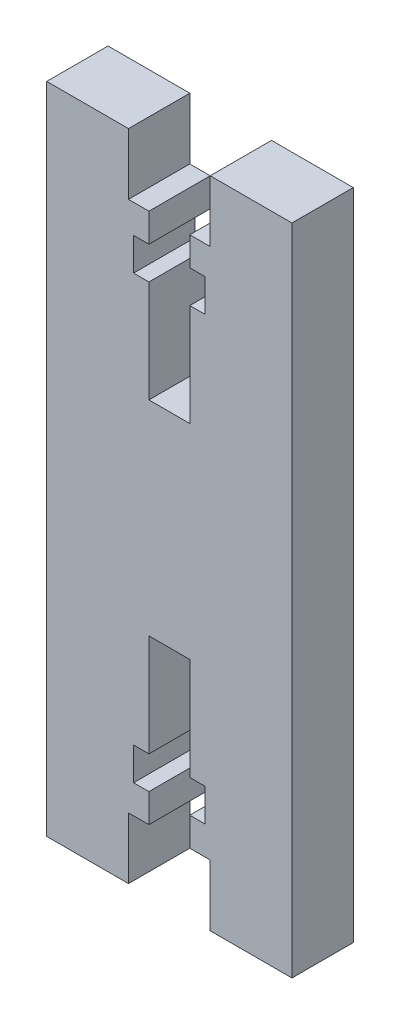
ISO-10303-21;
HEADER;
FILE_DESCRIPTION(('STEP AP214'),'2;1');
FILE_NAME('part.step','',(''),(''),'','','');
FILE_SCHEMA(('AUTOMOTIVE_DESIGN { 1 0 10303 214 1 1 1 1 }'));
ENDSEC;
DATA;
#1=APPLICATION_CONTEXT('core data for automotive mechanical design processes');
#2=APPLICATION_PROTOCOL_DEFINITION('international standard','automotive_design',2000,#1);
#3=PRODUCT_CONTEXT('',#1,'mechanical');
#4=PRODUCT('Part','Part','',(#3));
#5=PRODUCT_RELATED_PRODUCT_CATEGORY('part','',(#4));
#6=PRODUCT_DEFINITION_FORMATION('','',#4);
#7=PRODUCT_DEFINITION_CONTEXT('part definition',#1,'design');
#8=PRODUCT_DEFINITION('design','',#6,#7);
#9=PRODUCT_DEFINITION_SHAPE('','',#8);
#10=(LENGTH_UNIT() NAMED_UNIT(*) SI_UNIT(.MILLI.,.METRE.));
#11=(NAMED_UNIT(*) PLANE_ANGLE_UNIT() SI_UNIT($,.RADIAN.));
#12=(NAMED_UNIT(*) SI_UNIT($,.STERADIAN.) SOLID_ANGLE_UNIT());
#13=UNCERTAINTY_MEASURE_WITH_UNIT(LENGTH_MEASURE(1.E-05),#10,'distance_accuracy_value','');
#14=(GEOMETRIC_REPRESENTATION_CONTEXT(3) GLOBAL_UNCERTAINTY_ASSIGNED_CONTEXT((#13)) GLOBAL_UNIT_ASSIGNED_CONTEXT((#10,
#11,#12)) REPRESENTATION_CONTEXT('',''));
#15=CARTESIAN_POINT('',(0.,0.,0.));
#16=DIRECTION('',(0.,0.,1.));
#17=DIRECTION('',(1.,0.,0.));
#18=AXIS2_PLACEMENT_3D('',#15,#16,#17);
#19=CARTESIAN_POINT('',(0.,0.,6.));
#20=DIRECTION('',(1.,0.,0.));
#21=DIRECTION('',(0.,0.,-1.));
#22=AXIS2_PLACEMENT_3D('',#19,#20,#21);
#23=PLANE('',#22);
#24=DIRECTION('',(0.,-1.,0.));
#25=VECTOR('',#24,1.);
#26=CARTESIAN_POINT('',(0.,0.,0.));
#27=LINE('',#26,#25);
#28=CARTESIAN_POINT('',(0.,64.,0.));
#29=VERTEX_POINT('',#28);
#30=CARTESIAN_POINT('',(0.,0.,0.));
#31=VERTEX_POINT('',#30);
#32=EDGE_CURVE('E296',#29,#31,#27,.T.);
#33=ORIENTED_EDGE('',*,*,#32,.T.);
#34=DIRECTION('',(0.,0.,-1.));
#35=VECTOR('',#34,1.);
#36=CARTESIAN_POINT('',(0.,0.,6.));
#37=LINE('',#36,#35);
#38=CARTESIAN_POINT('',(0.,0.,6.));
#39=VERTEX_POINT('',#38);
#40=EDGE_CURVE('E11',#39,#31,#37,.T.);
#41=ORIENTED_EDGE('',*,*,#40,.F.);
#42=DIRECTION('',(0.,-1.,0.));
#43=VECTOR('',#42,1.);
#44=CARTESIAN_POINT('',(0.,0.,6.));
#45=LINE('',#44,#43);
#46=CARTESIAN_POINT('',(0.,64.,6.));
#47=VERTEX_POINT('',#46);
#48=EDGE_CURVE('E366',#47,#39,#45,.T.);
#49=ORIENTED_EDGE('',*,*,#48,.F.);
#50=DIRECTION('',(0.,0.,-1.));
#51=VECTOR('',#50,1.);
#52=CARTESIAN_POINT('',(0.,64.,6.));
#53=LINE('',#52,#51);
#54=EDGE_CURVE('E292',#47,#29,#53,.T.);
#55=ORIENTED_EDGE('',*,*,#54,.T.);
#56=EDGE_LOOP('',(#33,#41,#49,#55));
#57=FACE_BOUND('',#56,.T.);
#58=ADVANCED_FACE('F32',(#57),#23,.F.);
#59=CARTESIAN_POINT('',(0.,0.,6.));
#60=DIRECTION('',(0.,1.,0.));
#61=DIRECTION('',(0.,0.,1.));
#62=AXIS2_PLACEMENT_3D('',#59,#60,#61);
#63=PLANE('',#62);
#64=DIRECTION('',(1.,0.,0.));
#65=VECTOR('',#64,1.);
#66=CARTESIAN_POINT('',(0.,0.,0.));
#67=LINE('',#66,#65);
#68=CARTESIAN_POINT('',(8.,0.,0.));
#69=VERTEX_POINT('',#68);
#70=EDGE_CURVE('E299',#31,#69,#67,.T.);
#71=ORIENTED_EDGE('',*,*,#70,.T.);
#72=DIRECTION('',(0.,0.,-1.));
#73=VECTOR('',#72,1.);
#74=CARTESIAN_POINT('',(8.,0.,6.));
#75=LINE('',#74,#73);
#76=CARTESIAN_POINT('',(8.,0.,6.));
#77=VERTEX_POINT('',#76);
#78=EDGE_CURVE('E40',#77,#69,#75,.T.);
#79=ORIENTED_EDGE('',*,*,#78,.F.);
#80=DIRECTION('',(1.,0.,0.));
#81=VECTOR('',#80,1.);
#82=CARTESIAN_POINT('',(0.,0.,6.));
#83=LINE('',#82,#81);
#84=EDGE_CURVE('E175',#39,#77,#83,.T.);
#85=ORIENTED_EDGE('',*,*,#84,.F.);
#86=ORIENTED_EDGE('',*,*,#40,.T.);
#87=EDGE_LOOP('',(#71,#79,#85,#86));
#88=FACE_BOUND('',#87,.T.);
#89=ADVANCED_FACE('F564',(#88),#63,.F.);
#90=CARTESIAN_POINT('',(8.,0.,6.));
#91=DIRECTION('',(-1.,0.,0.));
#92=DIRECTION('',(0.,0.,1.));
#93=AXIS2_PLACEMENT_3D('',#90,#91,#92);
#94=PLANE('',#93);
#95=DIRECTION('',(0.,1.,0.));
#96=VECTOR('',#95,1.);
#97=CARTESIAN_POINT('',(8.,0.,0.));
#98=LINE('',#97,#96);
#99=CARTESIAN_POINT('',(8.,6.,0.));
#100=VERTEX_POINT('',#99);
#101=EDGE_CURVE('E301',#69,#100,#98,.T.);
#102=ORIENTED_EDGE('',*,*,#101,.T.);
#103=DIRECTION('',(0.,0.,-1.));
#104=VECTOR('',#103,1.);
#105=CARTESIAN_POINT('',(8.,6.,6.));
#106=LINE('',#105,#104);
#107=CARTESIAN_POINT('',(8.,6.,6.));
#108=VERTEX_POINT('',#107);
#109=EDGE_CURVE('E457',#108,#100,#106,.T.);
#110=ORIENTED_EDGE('',*,*,#109,.F.);
#111=DIRECTION('',(0.,1.,0.));
#112=VECTOR('',#111,1.);
#113=CARTESIAN_POINT('',(8.,0.,6.));
#114=LINE('',#113,#112);
#115=EDGE_CURVE('E465',#77,#108,#114,.T.);
#116=ORIENTED_EDGE('',*,*,#115,.F.);
#117=ORIENTED_EDGE('',*,*,#78,.T.);
#118=EDGE_LOOP('',(#102,#110,#116,#117));
#119=FACE_BOUND('',#118,.T.);
#120=ADVANCED_FACE('F463',(#119),#94,.F.);
#121=CARTESIAN_POINT('',(8.,6.,6.));
#122=DIRECTION('',(0.,1.,0.));
#123=DIRECTION('',(0.,0.,1.));
#124=AXIS2_PLACEMENT_3D('',#121,#122,#123);
#125=PLANE('',#124);
#126=DIRECTION('',(1.,0.,0.));
#127=VECTOR('',#126,1.);
#128=CARTESIAN_POINT('',(8.,6.,0.));
#129=LINE('',#128,#127);
#130=CARTESIAN_POINT('',(10.,6.,0.));
#131=VERTEX_POINT('',#130);
#132=EDGE_CURVE('E303',#100,#131,#129,.T.);
#133=ORIENTED_EDGE('',*,*,#132,.T.);
#134=DIRECTION('',(0.,0.,-1.));
#135=VECTOR('',#134,1.);
#136=CARTESIAN_POINT('',(10.,6.,6.));
#137=LINE('',#136,#135);
#138=CARTESIAN_POINT('',(10.,6.,6.));
#139=VERTEX_POINT('',#138);
#140=EDGE_CURVE('E454',#139,#131,#137,.T.);
#141=ORIENTED_EDGE('',*,*,#140,.F.);
#142=DIRECTION('',(1.,0.,0.));
#143=VECTOR('',#142,1.);
#144=CARTESIAN_POINT('',(8.,6.,6.));
#145=LINE('',#144,#143);
#146=EDGE_CURVE('E483',#108,#139,#145,.T.);
#147=ORIENTED_EDGE('',*,*,#146,.F.);
#148=ORIENTED_EDGE('',*,*,#109,.T.);
#149=EDGE_LOOP('',(#133,#141,#147,#148));
#150=FACE_BOUND('',#149,.T.);
#151=ADVANCED_FACE('F474',(#150),#125,.F.);
#152=CARTESIAN_POINT('',(10.,6.,6.));
#153=DIRECTION('',(-1.,0.,0.));
#154=DIRECTION('',(0.,-1.,0.));
#155=AXIS2_PLACEMENT_3D('',#152,#153,#154);
#156=PLANE('',#155);
#157=DIRECTION('',(0.,1.,0.));
#158=VECTOR('',#157,1.);
#159=CARTESIAN_POINT('',(10.,6.,0.));
#160=LINE('',#159,#158);
#161=CARTESIAN_POINT('',(10.,8.8,0.));
#162=VERTEX_POINT('',#161);
#163=EDGE_CURVE('E305',#131,#162,#160,.T.);
#164=ORIENTED_EDGE('',*,*,#163,.T.);
#165=DIRECTION('',(0.,0.,-1.));
#166=VECTOR('',#165,1.);
#167=CARTESIAN_POINT('',(10.,8.8,6.));
#168=LINE('',#167,#166);
#169=CARTESIAN_POINT('',(10.,8.8,6.));
#170=VERTEX_POINT('',#169);
#171=EDGE_CURVE('E451',#170,#162,#168,.T.);
#172=ORIENTED_EDGE('',*,*,#171,.F.);
#173=DIRECTION('',(0.,1.,0.));
#174=VECTOR('',#173,1.);
#175=CARTESIAN_POINT('',(10.,6.,6.));
#176=LINE('',#175,#174);
#177=EDGE_CURVE('E480',#139,#170,#176,.T.);
#178=ORIENTED_EDGE('',*,*,#177,.F.);
#179=ORIENTED_EDGE('',*,*,#140,.T.);
#180=EDGE_LOOP('',(#164,#172,#178,#179));
#181=FACE_BOUND('',#180,.T.);
#182=ADVANCED_FACE('F478',(#181),#156,.F.);
#183=CARTESIAN_POINT('',(10.,8.8,6.));
#184=DIRECTION('',(0.,-1.,0.));
#185=DIRECTION('',(0.,0.,-1.));
#186=AXIS2_PLACEMENT_3D('',#183,#184,#185);
#187=PLANE('',#186);
#188=DIRECTION('',(-1.,0.,0.));
#189=VECTOR('',#188,1.);
#190=CARTESIAN_POINT('',(10.,8.8,0.));
#191=LINE('',#190,#189);
#192=CARTESIAN_POINT('',(8.5,8.8,0.));
#193=VERTEX_POINT('',#192);
#194=EDGE_CURVE('E307',#162,#193,#191,.T.);
#195=ORIENTED_EDGE('',*,*,#194,.T.);
#196=DIRECTION('',(0.,0.,-1.));
#197=VECTOR('',#196,1.);
#198=CARTESIAN_POINT('',(8.5,8.8,6.));
#199=LINE('',#198,#197);
#200=CARTESIAN_POINT('',(8.5,8.8,6.));
#201=VERTEX_POINT('',#200);
#202=EDGE_CURVE('E448',#201,#193,#199,.T.);
#203=ORIENTED_EDGE('',*,*,#202,.F.);
#204=DIRECTION('',(-1.,0.,0.));
#205=VECTOR('',#204,1.);
#206=CARTESIAN_POINT('',(10.,8.8,6.));
#207=LINE('',#206,#205);
#208=EDGE_CURVE('E482',#170,#201,#207,.T.);
#209=ORIENTED_EDGE('',*,*,#208,.F.);
#210=ORIENTED_EDGE('',*,*,#171,.T.);
#211=EDGE_LOOP('',(#195,#203,#209,#210));
#212=FACE_BOUND('',#211,.T.);
#213=ADVANCED_FACE('F577',(#212),#187,.F.);
#214=CARTESIAN_POINT('',(8.5,8.8,6.));
#215=DIRECTION('',(-1.,0.,0.));
#216=DIRECTION('',(0.,0.,1.));
#217=AXIS2_PLACEMENT_3D('',#214,#215,#216);
#218=PLANE('',#217);
#219=DIRECTION('',(0.,1.,0.));
#220=VECTOR('',#219,1.);
#221=CARTESIAN_POINT('',(8.5,8.8,0.));
#222=LINE('',#221,#220);
#223=CARTESIAN_POINT('',(8.5,12.,0.));
#224=VERTEX_POINT('',#223);
#225=EDGE_CURVE('E309',#193,#224,#222,.T.);
#226=ORIENTED_EDGE('',*,*,#225,.T.);
#227=DIRECTION('',(0.,0.,-1.));
#228=VECTOR('',#227,1.);
#229=CARTESIAN_POINT('',(8.5,12.,6.));
#230=LINE('',#229,#228);
#231=CARTESIAN_POINT('',(8.5,12.,6.));
#232=VERTEX_POINT('',#231);
#233=EDGE_CURVE('E445',#232,#224,#230,.T.);
#234=ORIENTED_EDGE('',*,*,#233,.F.);
#235=DIRECTION('',(0.,1.,0.));
#236=VECTOR('',#235,1.);
#237=CARTESIAN_POINT('',(8.5,8.8,6.));
#238=LINE('',#237,#236);
#239=EDGE_CURVE('E485',#201,#232,#238,.T.);
#240=ORIENTED_EDGE('',*,*,#239,.F.);
#241=ORIENTED_EDGE('',*,*,#202,.T.);
#242=EDGE_LOOP('',(#226,#234,#240,#241));
#243=FACE_BOUND('',#242,.T.);
#244=ADVANCED_FACE('F580',(#243),#218,.F.);
#245=CARTESIAN_POINT('',(8.5,12.,6.));
#246=DIRECTION('',(0.,1.,0.));
#247=DIRECTION('',(0.,0.,1.));
#248=AXIS2_PLACEMENT_3D('',#245,#246,#247);
#249=PLANE('',#248);
#250=DIRECTION('',(1.,0.,0.));
#251=VECTOR('',#250,1.);
#252=CARTESIAN_POINT('',(8.5,12.,0.));
#253=LINE('',#252,#251);
#254=CARTESIAN_POINT('',(10.,12.,0.));
#255=VERTEX_POINT('',#254);
#256=EDGE_CURVE('E311',#224,#255,#253,.T.);
#257=ORIENTED_EDGE('',*,*,#256,.T.);
#258=DIRECTION('',(0.,0.,-1.));
#259=VECTOR('',#258,1.);
#260=CARTESIAN_POINT('',(10.,12.,6.));
#261=LINE('',#260,#259);
#262=CARTESIAN_POINT('',(10.,12.,6.));
#263=VERTEX_POINT('',#262);
#264=EDGE_CURVE('E442',#263,#255,#261,.T.);
#265=ORIENTED_EDGE('',*,*,#264,.F.);
#266=DIRECTION('',(1.,0.,0.));
#267=VECTOR('',#266,1.);
#268=CARTESIAN_POINT('',(8.5,12.,6.));
#269=LINE('',#268,#267);
#270=EDGE_CURVE('E491',#232,#263,#269,.T.);
#271=ORIENTED_EDGE('',*,*,#270,.F.);
#272=ORIENTED_EDGE('',*,*,#233,.T.);
#273=EDGE_LOOP('',(#257,#265,#271,#272));
#274=FACE_BOUND('',#273,.T.);
#275=ADVANCED_FACE('F584',(#274),#249,.F.);
#276=CARTESIAN_POINT('',(10.,12.,6.));
#277=DIRECTION('',(-1.,0.,0.));
#278=DIRECTION('',(0.,0.,1.));
#279=AXIS2_PLACEMENT_3D('',#276,#277,#278);
#280=PLANE('',#279);
#281=DIRECTION('',(0.,1.,0.));
#282=VECTOR('',#281,1.);
#283=CARTESIAN_POINT('',(10.,12.,0.));
#284=LINE('',#283,#282);
#285=CARTESIAN_POINT('',(10.,22.,0.));
#286=VERTEX_POINT('',#285);
#287=EDGE_CURVE('E313',#255,#286,#284,.T.);
#288=ORIENTED_EDGE('',*,*,#287,.T.);
#289=DIRECTION('',(0.,0.,-1.));
#290=VECTOR('',#289,1.);
#291=CARTESIAN_POINT('',(10.,22.,6.));
#292=LINE('',#291,#290);
#293=CARTESIAN_POINT('',(10.,22.,6.));
#294=VERTEX_POINT('',#293);
#295=EDGE_CURVE('E439',#294,#286,#292,.T.);
#296=ORIENTED_EDGE('',*,*,#295,.F.);
#297=DIRECTION('',(0.,1.,0.));
#298=VECTOR('',#297,1.);
#299=CARTESIAN_POINT('',(10.,12.,6.));
#300=LINE('',#299,#298);
#301=EDGE_CURVE('E493',#263,#294,#300,.T.);
#302=ORIENTED_EDGE('',*,*,#301,.F.);
#303=ORIENTED_EDGE('',*,*,#264,.T.);
#304=EDGE_LOOP('',(#288,#296,#302,#303));
#305=FACE_BOUND('',#304,.T.);
#306=ADVANCED_FACE('F588',(#305),#280,.F.);
#307=CARTESIAN_POINT('',(10.,22.,6.));
#308=DIRECTION('',(0.,1.,0.));
#309=DIRECTION('',(0.,0.,1.));
#310=AXIS2_PLACEMENT_3D('',#307,#308,#309);
#311=PLANE('',#310);
#312=DIRECTION('',(1.,0.,0.));
#313=VECTOR('',#312,1.);
#314=CARTESIAN_POINT('',(10.,22.,0.));
#315=LINE('',#314,#313);
#316=CARTESIAN_POINT('',(14.,22.,0.));
#317=VERTEX_POINT('',#316);
#318=EDGE_CURVE('E315',#286,#317,#315,.T.);
#319=ORIENTED_EDGE('',*,*,#318,.T.);
#320=DIRECTION('',(0.,0.,-1.));
#321=VECTOR('',#320,1.);
#322=CARTESIAN_POINT('',(14.,22.,6.));
#323=LINE('',#322,#321);
#324=CARTESIAN_POINT('',(14.,22.,6.));
#325=VERTEX_POINT('',#324);
#326=EDGE_CURVE('E436',#325,#317,#323,.T.);
#327=ORIENTED_EDGE('',*,*,#326,.F.);
#328=DIRECTION('',(1.,0.,0.));
#329=VECTOR('',#328,1.);
#330=CARTESIAN_POINT('',(10.,22.,6.));
#331=LINE('',#330,#329);
#332=EDGE_CURVE('E495',#294,#325,#331,.T.);
#333=ORIENTED_EDGE('',*,*,#332,.F.);
#334=ORIENTED_EDGE('',*,*,#295,.T.);
#335=EDGE_LOOP('',(#319,#327,#333,#334));
#336=FACE_BOUND('',#335,.T.);
#337=ADVANCED_FACE('F592',(#336),#311,.F.);
#338=CARTESIAN_POINT('',(14.,22.,6.));
#339=DIRECTION('',(1.,0.,0.));
#340=DIRECTION('',(0.,1.,0.));
#341=AXIS2_PLACEMENT_3D('',#338,#339,#340);
#342=PLANE('',#341);
#343=DIRECTION('',(0.,-1.,0.));
#344=VECTOR('',#343,1.);
#345=CARTESIAN_POINT('',(14.,22.,0.));
#346=LINE('',#345,#344);
#347=CARTESIAN_POINT('',(14.,12.,0.));
#348=VERTEX_POINT('',#347);
#349=EDGE_CURVE('E317',#317,#348,#346,.T.);
#350=ORIENTED_EDGE('',*,*,#349,.T.);
#351=DIRECTION('',(0.,0.,-1.));
#352=VECTOR('',#351,1.);
#353=CARTESIAN_POINT('',(14.,12.,6.));
#354=LINE('',#353,#352);
#355=CARTESIAN_POINT('',(14.,12.,6.));
#356=VERTEX_POINT('',#355);
#357=EDGE_CURVE('E433',#356,#348,#354,.T.);
#358=ORIENTED_EDGE('',*,*,#357,.F.);
#359=DIRECTION('',(0.,-1.,0.));
#360=VECTOR('',#359,1.);
#361=CARTESIAN_POINT('',(14.,22.,6.));
#362=LINE('',#361,#360);
#363=EDGE_CURVE('E497',#325,#356,#362,.T.);
#364=ORIENTED_EDGE('',*,*,#363,.F.);
#365=ORIENTED_EDGE('',*,*,#326,.T.);
#366=EDGE_LOOP('',(#350,#358,#364,#365));
#367=FACE_BOUND('',#366,.T.);
#368=ADVANCED_FACE('F596',(#367),#342,.F.);
#369=CARTESIAN_POINT('',(14.,12.,6.));
#370=DIRECTION('',(0.,1.,0.));
#371=DIRECTION('',(0.,0.,1.));
#372=AXIS2_PLACEMENT_3D('',#369,#370,#371);
#373=PLANE('',#372);
#374=DIRECTION('',(1.,0.,0.));
#375=VECTOR('',#374,1.);
#376=CARTESIAN_POINT('',(14.,12.,0.));
#377=LINE('',#376,#375);
#378=CARTESIAN_POINT('',(15.5,12.,0.));
#379=VERTEX_POINT('',#378);
#380=EDGE_CURVE('E319',#348,#379,#377,.T.);
#381=ORIENTED_EDGE('',*,*,#380,.T.);
#382=DIRECTION('',(0.,0.,-1.));
#383=VECTOR('',#382,1.);
#384=CARTESIAN_POINT('',(15.5,12.,6.));
#385=LINE('',#384,#383);
#386=CARTESIAN_POINT('',(15.5,12.,6.));
#387=VERTEX_POINT('',#386);
#388=EDGE_CURVE('E430',#387,#379,#385,.T.);
#389=ORIENTED_EDGE('',*,*,#388,.F.);
#390=DIRECTION('',(1.,0.,0.));
#391=VECTOR('',#390,1.);
#392=CARTESIAN_POINT('',(14.,12.,6.));
#393=LINE('',#392,#391);
#394=EDGE_CURVE('E499',#356,#387,#393,.T.);
#395=ORIENTED_EDGE('',*,*,#394,.F.);
#396=ORIENTED_EDGE('',*,*,#357,.T.);
#397=EDGE_LOOP('',(#381,#389,#395,#396));
#398=FACE_BOUND('',#397,.T.);
#399=ADVANCED_FACE('F600',(#398),#373,.F.);
#400=CARTESIAN_POINT('',(15.5,12.,6.));
#401=DIRECTION('',(1.,0.,0.));
#402=DIRECTION('',(0.,1.,0.));
#403=AXIS2_PLACEMENT_3D('',#400,#401,#402);
#404=PLANE('',#403);
#405=DIRECTION('',(0.,-1.,0.));
#406=VECTOR('',#405,1.);
#407=CARTESIAN_POINT('',(15.5,12.,0.));
#408=LINE('',#407,#406);
#409=CARTESIAN_POINT('',(15.5,8.8,0.));
#410=VERTEX_POINT('',#409);
#411=EDGE_CURVE('E321',#379,#410,#408,.T.);
#412=ORIENTED_EDGE('',*,*,#411,.T.);
#413=DIRECTION('',(0.,0.,-1.));
#414=VECTOR('',#413,1.);
#415=CARTESIAN_POINT('',(15.5,8.8,6.));
#416=LINE('',#415,#414);
#417=CARTESIAN_POINT('',(15.5,8.8,6.));
#418=VERTEX_POINT('',#417);
#419=EDGE_CURVE('E427',#418,#410,#416,.T.);
#420=ORIENTED_EDGE('',*,*,#419,.F.);
#421=DIRECTION('',(0.,-1.,0.));
#422=VECTOR('',#421,1.);
#423=CARTESIAN_POINT('',(15.5,12.,6.));
#424=LINE('',#423,#422);
#425=EDGE_CURVE('E501',#387,#418,#424,.T.);
#426=ORIENTED_EDGE('',*,*,#425,.F.);
#427=ORIENTED_EDGE('',*,*,#388,.T.);
#428=EDGE_LOOP('',(#412,#420,#426,#427));
#429=FACE_BOUND('',#428,.T.);
#430=ADVANCED_FACE('F604',(#429),#404,.F.);
#431=CARTESIAN_POINT('',(15.5,8.8,6.));
#432=DIRECTION('',(0.,-1.,0.));
#433=DIRECTION('',(0.,0.,-1.));
#434=AXIS2_PLACEMENT_3D('',#431,#432,#433);
#435=PLANE('',#434);
#436=DIRECTION('',(-1.,0.,0.));
#437=VECTOR('',#436,1.);
#438=CARTESIAN_POINT('',(15.5,8.8,0.));
#439=LINE('',#438,#437);
#440=CARTESIAN_POINT('',(14.,8.8,0.));
#441=VERTEX_POINT('',#440);
#442=EDGE_CURVE('E323',#410,#441,#439,.T.);
#443=ORIENTED_EDGE('',*,*,#442,.T.);
#444=DIRECTION('',(0.,0.,-1.));
#445=VECTOR('',#444,1.);
#446=CARTESIAN_POINT('',(14.,8.8,6.));
#447=LINE('',#446,#445);
#448=CARTESIAN_POINT('',(14.,8.8,6.));
#449=VERTEX_POINT('',#448);
#450=EDGE_CURVE('E424',#449,#441,#447,.T.);
#451=ORIENTED_EDGE('',*,*,#450,.F.);
#452=DIRECTION('',(-1.,0.,0.));
#453=VECTOR('',#452,1.);
#454=CARTESIAN_POINT('',(15.5,8.8,6.));
#455=LINE('',#454,#453);
#456=EDGE_CURVE('E503',#418,#449,#455,.T.);
#457=ORIENTED_EDGE('',*,*,#456,.F.);
#458=ORIENTED_EDGE('',*,*,#419,.T.);
#459=EDGE_LOOP('',(#443,#451,#457,#458));
#460=FACE_BOUND('',#459,.T.);
#461=ADVANCED_FACE('F608',(#460),#435,.F.);
#462=CARTESIAN_POINT('',(14.,8.8,6.));
#463=DIRECTION('',(1.,0.,0.));
#464=DIRECTION('',(0.,0.,-1.));
#465=AXIS2_PLACEMENT_3D('',#462,#463,#464);
#466=PLANE('',#465);
#467=DIRECTION('',(0.,-1.,0.));
#468=VECTOR('',#467,1.);
#469=CARTESIAN_POINT('',(14.,8.8,0.));
#470=LINE('',#469,#468);
#471=CARTESIAN_POINT('',(14.,6.,0.));
#472=VERTEX_POINT('',#471);
#473=EDGE_CURVE('E325',#441,#472,#470,.T.);
#474=ORIENTED_EDGE('',*,*,#473,.T.);
#475=DIRECTION('',(0.,0.,-1.));
#476=VECTOR('',#475,1.);
#477=CARTESIAN_POINT('',(14.,6.,6.));
#478=LINE('',#477,#476);
#479=CARTESIAN_POINT('',(14.,6.,6.));
#480=VERTEX_POINT('',#479);
#481=EDGE_CURVE('E421',#480,#472,#478,.T.);
#482=ORIENTED_EDGE('',*,*,#481,.F.);
#483=DIRECTION('',(0.,-1.,0.));
#484=VECTOR('',#483,1.);
#485=CARTESIAN_POINT('',(14.,8.8,6.));
#486=LINE('',#485,#484);
#487=EDGE_CURVE('E505',#449,#480,#486,.T.);
#488=ORIENTED_EDGE('',*,*,#487,.F.);
#489=ORIENTED_EDGE('',*,*,#450,.T.);
#490=EDGE_LOOP('',(#474,#482,#488,#489));
#491=FACE_BOUND('',#490,.T.);
#492=ADVANCED_FACE('F612',(#491),#466,.F.);
#493=CARTESIAN_POINT('',(14.,6.,6.));
#494=DIRECTION('',(0.,1.,0.));
#495=DIRECTION('',(0.,0.,1.));
#496=AXIS2_PLACEMENT_3D('',#493,#494,#495);
#497=PLANE('',#496);
#498=DIRECTION('',(1.,0.,0.));
#499=VECTOR('',#498,1.);
#500=CARTESIAN_POINT('',(14.,6.,0.));
#501=LINE('',#500,#499);
#502=CARTESIAN_POINT('',(16.,6.,0.));
#503=VERTEX_POINT('',#502);
#504=EDGE_CURVE('E327',#472,#503,#501,.T.);
#505=ORIENTED_EDGE('',*,*,#504,.T.);
#506=DIRECTION('',(0.,0.,-1.));
#507=VECTOR('',#506,1.);
#508=CARTESIAN_POINT('',(16.,6.,6.));
#509=LINE('',#508,#507);
#510=CARTESIAN_POINT('',(16.,6.,6.));
#511=VERTEX_POINT('',#510);
#512=EDGE_CURVE('E418',#511,#503,#509,.T.);
#513=ORIENTED_EDGE('',*,*,#512,.F.);
#514=DIRECTION('',(1.,0.,0.));
#515=VECTOR('',#514,1.);
#516=CARTESIAN_POINT('',(14.,6.,6.));
#517=LINE('',#516,#515);
#518=EDGE_CURVE('E507',#480,#511,#517,.T.);
#519=ORIENTED_EDGE('',*,*,#518,.F.);
#520=ORIENTED_EDGE('',*,*,#481,.T.);
#521=EDGE_LOOP('',(#505,#513,#519,#520));
#522=FACE_BOUND('',#521,.T.);
#523=ADVANCED_FACE('F616',(#522),#497,.F.);
#524=CARTESIAN_POINT('',(16.,6.,6.));
#525=DIRECTION('',(1.,0.,0.));
#526=DIRECTION('',(0.,0.,-1.));
#527=AXIS2_PLACEMENT_3D('',#524,#525,#526);
#528=PLANE('',#527);
#529=DIRECTION('',(0.,-1.,0.));
#530=VECTOR('',#529,1.);
#531=CARTESIAN_POINT('',(16.,6.,0.));
#532=LINE('',#531,#530);
#533=CARTESIAN_POINT('',(16.,0.,0.));
#534=VERTEX_POINT('',#533);
#535=EDGE_CURVE('E329',#503,#534,#532,.T.);
#536=ORIENTED_EDGE('',*,*,#535,.T.);
#537=DIRECTION('',(0.,0.,-1.));
#538=VECTOR('',#537,1.);
#539=CARTESIAN_POINT('',(16.,0.,6.));
#540=LINE('',#539,#538);
#541=CARTESIAN_POINT('',(16.,0.,6.));
#542=VERTEX_POINT('',#541);
#543=EDGE_CURVE('E415',#542,#534,#540,.T.);
#544=ORIENTED_EDGE('',*,*,#543,.F.);
#545=DIRECTION('',(0.,-1.,0.));
#546=VECTOR('',#545,1.);
#547=CARTESIAN_POINT('',(16.,6.,6.));
#548=LINE('',#547,#546);
#549=EDGE_CURVE('E509',#511,#542,#548,.T.);
#550=ORIENTED_EDGE('',*,*,#549,.F.);
#551=ORIENTED_EDGE('',*,*,#512,.T.);
#552=EDGE_LOOP('',(#536,#544,#550,#551));
#553=FACE_BOUND('',#552,.T.);
#554=ADVANCED_FACE('F620',(#553),#528,.F.);
#555=CARTESIAN_POINT('',(16.,0.,6.));
#556=DIRECTION('',(0.,1.,0.));
#557=DIRECTION('',(0.,0.,1.));
#558=AXIS2_PLACEMENT_3D('',#555,#556,#557);
#559=PLANE('',#558);
#560=DIRECTION('',(1.,0.,0.));
#561=VECTOR('',#560,1.);
#562=CARTESIAN_POINT('',(16.,0.,0.));
#563=LINE('',#562,#561);
#564=CARTESIAN_POINT('',(24.,0.,0.));
#565=VERTEX_POINT('',#564);
#566=EDGE_CURVE('E331',#534,#565,#563,.T.);
#567=ORIENTED_EDGE('',*,*,#566,.T.);
#568=DIRECTION('',(0.,0.,-1.));
#569=VECTOR('',#568,1.);
#570=CARTESIAN_POINT('',(24.,0.,6.));
#571=LINE('',#570,#569);
#572=CARTESIAN_POINT('',(24.,0.,6.));
#573=VERTEX_POINT('',#572);
#574=EDGE_CURVE('E412',#573,#565,#571,.T.);
#575=ORIENTED_EDGE('',*,*,#574,.F.);
#576=DIRECTION('',(1.,0.,0.));
#577=VECTOR('',#576,1.);
#578=CARTESIAN_POINT('',(16.,0.,6.));
#579=LINE('',#578,#577);
#580=EDGE_CURVE('E511',#542,#573,#579,.T.);
#581=ORIENTED_EDGE('',*,*,#580,.F.);
#582=ORIENTED_EDGE('',*,*,#543,.T.);
#583=EDGE_LOOP('',(#567,#575,#581,#582));
#584=FACE_BOUND('',#583,.T.);
#585=ADVANCED_FACE('F624',(#584),#559,.F.);
#586=CARTESIAN_POINT('',(24.,0.,6.));
#587=DIRECTION('',(-1.,0.,0.));
#588=DIRECTION('',(0.,0.,1.));
#589=AXIS2_PLACEMENT_3D('',#586,#587,#588);
#590=PLANE('',#589);
#591=DIRECTION('',(0.,1.,0.));
#592=VECTOR('',#591,1.);
#593=CARTESIAN_POINT('',(24.,0.,0.));
#594=LINE('',#593,#592);
#595=CARTESIAN_POINT('',(24.,64.,0.));
#596=VERTEX_POINT('',#595);
#597=EDGE_CURVE('E333',#565,#596,#594,.T.);
#598=ORIENTED_EDGE('',*,*,#597,.T.);
#599=DIRECTION('',(0.,0.,-1.));
#600=VECTOR('',#599,1.);
#601=CARTESIAN_POINT('',(24.,64.,6.));
#602=LINE('',#601,#600);
#603=CARTESIAN_POINT('',(24.,64.,6.));
#604=VERTEX_POINT('',#603);
#605=EDGE_CURVE('E409',#604,#596,#602,.T.);
#606=ORIENTED_EDGE('',*,*,#605,.F.);
#607=DIRECTION('',(0.,1.,0.));
#608=VECTOR('',#607,1.);
#609=CARTESIAN_POINT('',(24.,0.,6.));
#610=LINE('',#609,#608);
#611=EDGE_CURVE('E513',#573,#604,#610,.T.);
#612=ORIENTED_EDGE('',*,*,#611,.F.);
#613=ORIENTED_EDGE('',*,*,#574,.T.);
#614=EDGE_LOOP('',(#598,#606,#612,#613));
#615=FACE_BOUND('',#614,.T.);
#616=ADVANCED_FACE('F628',(#615),#590,.F.);
#617=CARTESIAN_POINT('',(16.,64.,6.));
#618=DIRECTION('',(0.,-1.,0.));
#619=DIRECTION('',(0.,0.,-1.));
#620=AXIS2_PLACEMENT_3D('',#617,#618,#619);
#621=PLANE('',#620);
#622=DIRECTION('',(-1.,0.,0.));
#623=VECTOR('',#622,1.);
#624=CARTESIAN_POINT('',(16.,64.,0.));
#625=LINE('',#624,#623);
#626=CARTESIAN_POINT('',(16.,64.,0.));
#627=VERTEX_POINT('',#626);
#628=EDGE_CURVE('E335',#596,#627,#625,.T.);
#629=ORIENTED_EDGE('',*,*,#628,.T.);
#630=DIRECTION('',(0.,0.,-1.));
#631=VECTOR('',#630,1.);
#632=CARTESIAN_POINT('',(16.,64.,6.));
#633=LINE('',#632,#631);
#634=CARTESIAN_POINT('',(16.,64.,6.));
#635=VERTEX_POINT('',#634);
#636=EDGE_CURVE('E406',#635,#627,#633,.T.);
#637=ORIENTED_EDGE('',*,*,#636,.F.);
#638=DIRECTION('',(-1.,0.,0.));
#639=VECTOR('',#638,1.);
#640=CARTESIAN_POINT('',(16.,64.,6.));
#641=LINE('',#640,#639);
#642=EDGE_CURVE('E515',#604,#635,#641,.T.);
#643=ORIENTED_EDGE('',*,*,#642,.F.);
#644=ORIENTED_EDGE('',*,*,#605,.T.);
#645=EDGE_LOOP('',(#629,#637,#643,#644));
#646=FACE_BOUND('',#645,.T.);
#647=ADVANCED_FACE('F632',(#646),#621,.F.);
#648=CARTESIAN_POINT('',(16.,58.,6.));
#649=DIRECTION('',(1.,0.,0.));
#650=DIRECTION('',(0.,1.,0.));
#651=AXIS2_PLACEMENT_3D('',#648,#649,#650);
#652=PLANE('',#651);
#653=DIRECTION('',(0.,-1.,0.));
#654=VECTOR('',#653,1.);
#655=CARTESIAN_POINT('',(16.,58.,0.));
#656=LINE('',#655,#654);
#657=CARTESIAN_POINT('',(16.,58.,0.));
#658=VERTEX_POINT('',#657);
#659=EDGE_CURVE('E337',#627,#658,#656,.T.);
#660=ORIENTED_EDGE('',*,*,#659,.T.);
#661=DIRECTION('',(0.,0.,-1.));
#662=VECTOR('',#661,1.);
#663=CARTESIAN_POINT('',(16.,58.,6.));
#664=LINE('',#663,#662);
#665=CARTESIAN_POINT('',(16.,58.,6.));
#666=VERTEX_POINT('',#665);
#667=EDGE_CURVE('E403',#666,#658,#664,.T.);
#668=ORIENTED_EDGE('',*,*,#667,.F.);
#669=DIRECTION('',(0.,-1.,0.));
#670=VECTOR('',#669,1.);
#671=CARTESIAN_POINT('',(16.,58.,6.));
#672=LINE('',#671,#670);
#673=EDGE_CURVE('E517',#635,#666,#672,.T.);
#674=ORIENTED_EDGE('',*,*,#673,.F.);
#675=ORIENTED_EDGE('',*,*,#636,.T.);
#676=EDGE_LOOP('',(#660,#668,#674,#675));
#677=FACE_BOUND('',#676,.T.);
#678=ADVANCED_FACE('F636',(#677),#652,.F.);
#679=CARTESIAN_POINT('',(14.,58.,6.));
#680=DIRECTION('',(0.,-1.,0.));
#681=DIRECTION('',(0.,0.,-1.));
#682=AXIS2_PLACEMENT_3D('',#679,#680,#681);
#683=PLANE('',#682);
#684=DIRECTION('',(-1.,0.,0.));
#685=VECTOR('',#684,1.);
#686=CARTESIAN_POINT('',(14.,58.,0.));
#687=LINE('',#686,#685);
#688=CARTESIAN_POINT('',(14.,58.,0.));
#689=VERTEX_POINT('',#688);
#690=EDGE_CURVE('E339',#658,#689,#687,.T.);
#691=ORIENTED_EDGE('',*,*,#690,.T.);
#692=DIRECTION('',(0.,0.,-1.));
#693=VECTOR('',#692,1.);
#694=CARTESIAN_POINT('',(14.,58.,6.));
#695=LINE('',#694,#693);
#696=CARTESIAN_POINT('',(14.,58.,6.));
#697=VERTEX_POINT('',#696);
#698=EDGE_CURVE('E400',#697,#689,#695,.T.);
#699=ORIENTED_EDGE('',*,*,#698,.F.);
#700=DIRECTION('',(-1.,0.,0.));
#701=VECTOR('',#700,1.);
#702=CARTESIAN_POINT('',(14.,58.,6.));
#703=LINE('',#702,#701);
#704=EDGE_CURVE('E519',#666,#697,#703,.T.);
#705=ORIENTED_EDGE('',*,*,#704,.F.);
#706=ORIENTED_EDGE('',*,*,#667,.T.);
#707=EDGE_LOOP('',(#691,#699,#705,#706));
#708=FACE_BOUND('',#707,.T.);
#709=ADVANCED_FACE('F640',(#708),#683,.F.);
#710=CARTESIAN_POINT('',(14.,55.2,6.));
#711=DIRECTION('',(1.,0.,0.));
#712=DIRECTION('',(0.,1.,0.));
#713=AXIS2_PLACEMENT_3D('',#710,#711,#712);
#714=PLANE('',#713);
#715=DIRECTION('',(0.,-1.,0.));
#716=VECTOR('',#715,1.);
#717=CARTESIAN_POINT('',(14.,55.2,0.));
#718=LINE('',#717,#716);
#719=CARTESIAN_POINT('',(14.,55.2,0.));
#720=VERTEX_POINT('',#719);
#721=EDGE_CURVE('E341',#689,#720,#718,.T.);
#722=ORIENTED_EDGE('',*,*,#721,.T.);
#723=DIRECTION('',(0.,0.,-1.));
#724=VECTOR('',#723,1.);
#725=CARTESIAN_POINT('',(14.,55.2,6.));
#726=LINE('',#725,#724);
#727=CARTESIAN_POINT('',(14.,55.2,6.));
#728=VERTEX_POINT('',#727);
#729=EDGE_CURVE('E397',#728,#720,#726,.T.);
#730=ORIENTED_EDGE('',*,*,#729,.F.);
#731=DIRECTION('',(0.,-1.,0.));
#732=VECTOR('',#731,1.);
#733=CARTESIAN_POINT('',(14.,55.2,6.));
#734=LINE('',#733,#732);
#735=EDGE_CURVE('E521',#697,#728,#734,.T.);
#736=ORIENTED_EDGE('',*,*,#735,.F.);
#737=ORIENTED_EDGE('',*,*,#698,.T.);
#738=EDGE_LOOP('',(#722,#730,#736,#737));
#739=FACE_BOUND('',#738,.T.);
#740=ADVANCED_FACE('F644',(#739),#714,.F.);
#741=CARTESIAN_POINT('',(15.5,55.2,6.));
#742=DIRECTION('',(0.,1.,0.));
#743=DIRECTION('',(0.,0.,1.));
#744=AXIS2_PLACEMENT_3D('',#741,#742,#743);
#745=PLANE('',#744);
#746=DIRECTION('',(1.,0.,0.));
#747=VECTOR('',#746,1.);
#748=CARTESIAN_POINT('',(15.5,55.2,0.));
#749=LINE('',#748,#747);
#750=CARTESIAN_POINT('',(15.5,55.2,0.));
#751=VERTEX_POINT('',#750);
#752=EDGE_CURVE('E343',#720,#751,#749,.T.);
#753=ORIENTED_EDGE('',*,*,#752,.T.);
#754=DIRECTION('',(0.,0.,-1.));
#755=VECTOR('',#754,1.);
#756=CARTESIAN_POINT('',(15.5,55.2,6.));
#757=LINE('',#756,#755);
#758=CARTESIAN_POINT('',(15.5,55.2,6.));
#759=VERTEX_POINT('',#758);
#760=EDGE_CURVE('E394',#759,#751,#757,.T.);
#761=ORIENTED_EDGE('',*,*,#760,.F.);
#762=DIRECTION('',(1.,0.,0.));
#763=VECTOR('',#762,1.);
#764=CARTESIAN_POINT('',(15.5,55.2,6.));
#765=LINE('',#764,#763);
#766=EDGE_CURVE('E523',#728,#759,#765,.T.);
#767=ORIENTED_EDGE('',*,*,#766,.F.);
#768=ORIENTED_EDGE('',*,*,#729,.T.);
#769=EDGE_LOOP('',(#753,#761,#767,#768));
#770=FACE_BOUND('',#769,.T.);
#771=ADVANCED_FACE('F648',(#770),#745,.F.);
#772=CARTESIAN_POINT('',(15.5,52.,6.));
#773=DIRECTION('',(1.,0.,0.));
#774=DIRECTION('',(0.,0.,-1.));
#775=AXIS2_PLACEMENT_3D('',#772,#773,#774);
#776=PLANE('',#775);
#777=DIRECTION('',(0.,-1.,0.));
#778=VECTOR('',#777,1.);
#779=CARTESIAN_POINT('',(15.5,52.,0.));
#780=LINE('',#779,#778);
#781=CARTESIAN_POINT('',(15.5,52.,0.));
#782=VERTEX_POINT('',#781);
#783=EDGE_CURVE('E345',#751,#782,#780,.T.);
#784=ORIENTED_EDGE('',*,*,#783,.T.);
#785=DIRECTION('',(0.,0.,-1.));
#786=VECTOR('',#785,1.);
#787=CARTESIAN_POINT('',(15.5,52.,6.));
#788=LINE('',#787,#786);
#789=CARTESIAN_POINT('',(15.5,52.,6.));
#790=VERTEX_POINT('',#789);
#791=EDGE_CURVE('E391',#790,#782,#788,.T.);
#792=ORIENTED_EDGE('',*,*,#791,.F.);
#793=DIRECTION('',(0.,-1.,0.));
#794=VECTOR('',#793,1.);
#795=CARTESIAN_POINT('',(15.5,52.,6.));
#796=LINE('',#795,#794);
#797=EDGE_CURVE('E525',#759,#790,#796,.T.);
#798=ORIENTED_EDGE('',*,*,#797,.F.);
#799=ORIENTED_EDGE('',*,*,#760,.T.);
#800=EDGE_LOOP('',(#784,#792,#798,#799));
#801=FACE_BOUND('',#800,.T.);
#802=ADVANCED_FACE('F652',(#801),#776,.F.);
#803=CARTESIAN_POINT('',(14.,52.,6.));
#804=DIRECTION('',(0.,-1.,0.));
#805=DIRECTION('',(0.,0.,-1.));
#806=AXIS2_PLACEMENT_3D('',#803,#804,#805);
#807=PLANE('',#806);
#808=DIRECTION('',(-1.,0.,0.));
#809=VECTOR('',#808,1.);
#810=CARTESIAN_POINT('',(14.,52.,0.));
#811=LINE('',#810,#809);
#812=CARTESIAN_POINT('',(14.,52.,0.));
#813=VERTEX_POINT('',#812);
#814=EDGE_CURVE('E347',#782,#813,#811,.T.);
#815=ORIENTED_EDGE('',*,*,#814,.T.);
#816=DIRECTION('',(0.,0.,-1.));
#817=VECTOR('',#816,1.);
#818=CARTESIAN_POINT('',(14.,52.,6.));
#819=LINE('',#818,#817);
#820=CARTESIAN_POINT('',(14.,52.,6.));
#821=VERTEX_POINT('',#820);
#822=EDGE_CURVE('E388',#821,#813,#819,.T.);
#823=ORIENTED_EDGE('',*,*,#822,.F.);
#824=DIRECTION('',(-1.,0.,0.));
#825=VECTOR('',#824,1.);
#826=CARTESIAN_POINT('',(14.,52.,6.));
#827=LINE('',#826,#825);
#828=EDGE_CURVE('E527',#790,#821,#827,.T.);
#829=ORIENTED_EDGE('',*,*,#828,.F.);
#830=ORIENTED_EDGE('',*,*,#791,.T.);
#831=EDGE_LOOP('',(#815,#823,#829,#830));
#832=FACE_BOUND('',#831,.T.);
#833=ADVANCED_FACE('F656',(#832),#807,.F.);
#834=CARTESIAN_POINT('',(14.,42.,6.));
#835=DIRECTION('',(1.,0.,0.));
#836=DIRECTION('',(0.,1.,0.));
#837=AXIS2_PLACEMENT_3D('',#834,#835,#836);
#838=PLANE('',#837);
#839=DIRECTION('',(0.,-1.,0.));
#840=VECTOR('',#839,1.);
#841=CARTESIAN_POINT('',(14.,42.,0.));
#842=LINE('',#841,#840);
#843=CARTESIAN_POINT('',(14.,42.,0.));
#844=VERTEX_POINT('',#843);
#845=EDGE_CURVE('E349',#813,#844,#842,.T.);
#846=ORIENTED_EDGE('',*,*,#845,.T.);
#847=DIRECTION('',(0.,0.,-1.));
#848=VECTOR('',#847,1.);
#849=CARTESIAN_POINT('',(14.,42.,6.));
#850=LINE('',#849,#848);
#851=CARTESIAN_POINT('',(14.,42.,6.));
#852=VERTEX_POINT('',#851);
#853=EDGE_CURVE('E385',#852,#844,#850,.T.);
#854=ORIENTED_EDGE('',*,*,#853,.F.);
#855=DIRECTION('',(0.,-1.,0.));
#856=VECTOR('',#855,1.);
#857=CARTESIAN_POINT('',(14.,42.,6.));
#858=LINE('',#857,#856);
#859=EDGE_CURVE('E529',#821,#852,#858,.T.);
#860=ORIENTED_EDGE('',*,*,#859,.F.);
#861=ORIENTED_EDGE('',*,*,#822,.T.);
#862=EDGE_LOOP('',(#846,#854,#860,#861));
#863=FACE_BOUND('',#862,.T.);
#864=ADVANCED_FACE('F660',(#863),#838,.F.);
#865=CARTESIAN_POINT('',(10.,42.,6.));
#866=DIRECTION('',(0.,-1.,0.));
#867=DIRECTION('',(0.,0.,-1.));
#868=AXIS2_PLACEMENT_3D('',#865,#866,#867);
#869=PLANE('',#868);
#870=DIRECTION('',(-1.,0.,0.));
#871=VECTOR('',#870,1.);
#872=CARTESIAN_POINT('',(10.,42.,0.));
#873=LINE('',#872,#871);
#874=CARTESIAN_POINT('',(10.,42.,0.));
#875=VERTEX_POINT('',#874);
#876=EDGE_CURVE('E351',#844,#875,#873,.T.);
#877=ORIENTED_EDGE('',*,*,#876,.T.);
#878=DIRECTION('',(0.,0.,-1.));
#879=VECTOR('',#878,1.);
#880=CARTESIAN_POINT('',(10.,42.,6.));
#881=LINE('',#880,#879);
#882=CARTESIAN_POINT('',(10.,42.,6.));
#883=VERTEX_POINT('',#882);
#884=EDGE_CURVE('E382',#883,#875,#881,.T.);
#885=ORIENTED_EDGE('',*,*,#884,.F.);
#886=DIRECTION('',(-1.,0.,0.));
#887=VECTOR('',#886,1.);
#888=CARTESIAN_POINT('',(10.,42.,6.));
#889=LINE('',#888,#887);
#890=EDGE_CURVE('E531',#852,#883,#889,.T.);
#891=ORIENTED_EDGE('',*,*,#890,.F.);
#892=ORIENTED_EDGE('',*,*,#853,.T.);
#893=EDGE_LOOP('',(#877,#885,#891,#892));
#894=FACE_BOUND('',#893,.T.);
#895=ADVANCED_FACE('F664',(#894),#869,.F.);
#896=CARTESIAN_POINT('',(10.,52.,6.));
#897=DIRECTION('',(-1.,0.,0.));
#898=DIRECTION('',(0.,0.,1.));
#899=AXIS2_PLACEMENT_3D('',#896,#897,#898);
#900=PLANE('',#899);
#901=DIRECTION('',(0.,1.,0.));
#902=VECTOR('',#901,1.);
#903=CARTESIAN_POINT('',(10.,52.,0.));
#904=LINE('',#903,#902);
#905=CARTESIAN_POINT('',(10.,52.,0.));
#906=VERTEX_POINT('',#905);
#907=EDGE_CURVE('E353',#875,#906,#904,.T.);
#908=ORIENTED_EDGE('',*,*,#907,.T.);
#909=DIRECTION('',(0.,0.,-1.));
#910=VECTOR('',#909,1.);
#911=CARTESIAN_POINT('',(10.,52.,6.));
#912=LINE('',#911,#910);
#913=CARTESIAN_POINT('',(10.,52.,6.));
#914=VERTEX_POINT('',#913);
#915=EDGE_CURVE('E379',#914,#906,#912,.T.);
#916=ORIENTED_EDGE('',*,*,#915,.F.);
#917=DIRECTION('',(0.,1.,0.));
#918=VECTOR('',#917,1.);
#919=CARTESIAN_POINT('',(10.,52.,6.));
#920=LINE('',#919,#918);
#921=EDGE_CURVE('E533',#883,#914,#920,.T.);
#922=ORIENTED_EDGE('',*,*,#921,.F.);
#923=ORIENTED_EDGE('',*,*,#884,.T.);
#924=EDGE_LOOP('',(#908,#916,#922,#923));
#925=FACE_BOUND('',#924,.T.);
#926=ADVANCED_FACE('F668',(#925),#900,.F.);
#927=CARTESIAN_POINT('',(8.5,52.,6.));
#928=DIRECTION('',(0.,-1.,0.));
#929=DIRECTION('',(0.,0.,-1.));
#930=AXIS2_PLACEMENT_3D('',#927,#928,#929);
#931=PLANE('',#930);
#932=DIRECTION('',(-1.,0.,0.));
#933=VECTOR('',#932,1.);
#934=CARTESIAN_POINT('',(8.5,52.,0.));
#935=LINE('',#934,#933);
#936=CARTESIAN_POINT('',(8.5,52.,0.));
#937=VERTEX_POINT('',#936);
#938=EDGE_CURVE('E355',#906,#937,#935,.T.);
#939=ORIENTED_EDGE('',*,*,#938,.T.);
#940=DIRECTION('',(0.,0.,-1.));
#941=VECTOR('',#940,1.);
#942=CARTESIAN_POINT('',(8.5,52.,6.));
#943=LINE('',#942,#941);
#944=CARTESIAN_POINT('',(8.5,52.,6.));
#945=VERTEX_POINT('',#944);
#946=EDGE_CURVE('E376',#945,#937,#943,.T.);
#947=ORIENTED_EDGE('',*,*,#946,.F.);
#948=DIRECTION('',(-1.,0.,0.));
#949=VECTOR('',#948,1.);
#950=CARTESIAN_POINT('',(8.5,52.,6.));
#951=LINE('',#950,#949);
#952=EDGE_CURVE('E535',#914,#945,#951,.T.);
#953=ORIENTED_EDGE('',*,*,#952,.F.);
#954=ORIENTED_EDGE('',*,*,#915,.T.);
#955=EDGE_LOOP('',(#939,#947,#953,#954));
#956=FACE_BOUND('',#955,.T.);
#957=ADVANCED_FACE('F672',(#956),#931,.F.);
#958=CARTESIAN_POINT('',(8.5,55.2,6.));
#959=DIRECTION('',(-1.,0.,0.));
#960=DIRECTION('',(0.,0.,1.));
#961=AXIS2_PLACEMENT_3D('',#958,#959,#960);
#962=PLANE('',#961);
#963=DIRECTION('',(0.,1.,0.));
#964=VECTOR('',#963,1.);
#965=CARTESIAN_POINT('',(8.5,55.2,0.));
#966=LINE('',#965,#964);
#967=CARTESIAN_POINT('',(8.5,55.2,0.));
#968=VERTEX_POINT('',#967);
#969=EDGE_CURVE('E357',#937,#968,#966,.T.);
#970=ORIENTED_EDGE('',*,*,#969,.T.);
#971=DIRECTION('',(0.,0.,-1.));
#972=VECTOR('',#971,1.);
#973=CARTESIAN_POINT('',(8.5,55.2,6.));
#974=LINE('',#973,#972);
#975=CARTESIAN_POINT('',(8.5,55.2,6.));
#976=VERTEX_POINT('',#975);
#977=EDGE_CURVE('E373',#976,#968,#974,.T.);
#978=ORIENTED_EDGE('',*,*,#977,.F.);
#979=DIRECTION('',(0.,1.,0.));
#980=VECTOR('',#979,1.);
#981=CARTESIAN_POINT('',(8.5,55.2,6.));
#982=LINE('',#981,#980);
#983=EDGE_CURVE('E537',#945,#976,#982,.T.);
#984=ORIENTED_EDGE('',*,*,#983,.F.);
#985=ORIENTED_EDGE('',*,*,#946,.T.);
#986=EDGE_LOOP('',(#970,#978,#984,#985));
#987=FACE_BOUND('',#986,.T.);
#988=ADVANCED_FACE('F676',(#987),#962,.F.);
#989=CARTESIAN_POINT('',(10.,55.2,6.));
#990=DIRECTION('',(0.,1.,0.));
#991=DIRECTION('',(0.,0.,1.));
#992=AXIS2_PLACEMENT_3D('',#989,#990,#991);
#993=PLANE('',#992);
#994=DIRECTION('',(1.,0.,0.));
#995=VECTOR('',#994,1.);
#996=CARTESIAN_POINT('',(10.,55.2,0.));
#997=LINE('',#996,#995);
#998=CARTESIAN_POINT('',(10.,55.2,0.));
#999=VERTEX_POINT('',#998);
#1000=EDGE_CURVE('E359',#968,#999,#997,.T.);
#1001=ORIENTED_EDGE('',*,*,#1000,.T.);
#1002=DIRECTION('',(0.,0.,-1.));
#1003=VECTOR('',#1002,1.);
#1004=CARTESIAN_POINT('',(10.,55.2,6.));
#1005=LINE('',#1004,#1003);
#1006=CARTESIAN_POINT('',(10.,55.2,6.));
#1007=VERTEX_POINT('',#1006);
#1008=EDGE_CURVE('E370',#1007,#999,#1005,.T.);
#1009=ORIENTED_EDGE('',*,*,#1008,.F.);
#1010=DIRECTION('',(1.,0.,0.));
#1011=VECTOR('',#1010,1.);
#1012=CARTESIAN_POINT('',(10.,55.2,6.));
#1013=LINE('',#1012,#1011);
#1014=EDGE_CURVE('E539',#976,#1007,#1013,.T.);
#1015=ORIENTED_EDGE('',*,*,#1014,.F.);
#1016=ORIENTED_EDGE('',*,*,#977,.T.);
#1017=EDGE_LOOP('',(#1001,#1009,#1015,#1016));
#1018=FACE_BOUND('',#1017,.T.);
#1019=ADVANCED_FACE('F545',(#1018),#993,.F.);
#1020=CARTESIAN_POINT('',(10.,58.,6.));
#1021=DIRECTION('',(-1.,0.,0.));
#1022=DIRECTION('',(0.,0.,1.));
#1023=AXIS2_PLACEMENT_3D('',#1020,#1021,#1022);
#1024=PLANE('',#1023);
#1025=DIRECTION('',(0.,1.,0.));
#1026=VECTOR('',#1025,1.);
#1027=CARTESIAN_POINT('',(10.,58.,0.));
#1028=LINE('',#1027,#1026);
#1029=CARTESIAN_POINT('',(10.,58.,0.));
#1030=VERTEX_POINT('',#1029);
#1031=EDGE_CURVE('E361',#999,#1030,#1028,.T.);
#1032=ORIENTED_EDGE('',*,*,#1031,.T.);
#1033=DIRECTION('',(0.,0.,-1.));
#1034=VECTOR('',#1033,1.);
#1035=CARTESIAN_POINT('',(10.,58.,6.));
#1036=LINE('',#1035,#1034);
#1037=CARTESIAN_POINT('',(10.,58.,6.));
#1038=VERTEX_POINT('',#1037);
#1039=EDGE_CURVE('E287',#1038,#1030,#1036,.T.);
#1040=ORIENTED_EDGE('',*,*,#1039,.F.);
#1041=DIRECTION('',(0.,1.,0.));
#1042=VECTOR('',#1041,1.);
#1043=CARTESIAN_POINT('',(10.,58.,6.));
#1044=LINE('',#1043,#1042);
#1045=EDGE_CURVE('E278',#1007,#1038,#1044,.T.);
#1046=ORIENTED_EDGE('',*,*,#1045,.F.);
#1047=ORIENTED_EDGE('',*,*,#1008,.T.);
#1048=EDGE_LOOP('',(#1032,#1040,#1046,#1047));
#1049=FACE_BOUND('',#1048,.T.);
#1050=ADVANCED_FACE('F549',(#1049),#1024,.F.);
#1051=CARTESIAN_POINT('',(8.,58.,6.));
#1052=DIRECTION('',(0.,-1.,0.));
#1053=DIRECTION('',(0.,0.,-1.));
#1054=AXIS2_PLACEMENT_3D('',#1051,#1052,#1053);
#1055=PLANE('',#1054);
#1056=DIRECTION('',(-1.,0.,0.));
#1057=VECTOR('',#1056,1.);
#1058=CARTESIAN_POINT('',(8.,58.,0.));
#1059=LINE('',#1058,#1057);
#1060=CARTESIAN_POINT('',(8.,58.,0.));
#1061=VERTEX_POINT('',#1060);
#1062=EDGE_CURVE('E286',#1030,#1061,#1059,.T.);
#1063=ORIENTED_EDGE('',*,*,#1062,.T.);
#1064=DIRECTION('',(0.,0.,-1.));
#1065=VECTOR('',#1064,1.);
#1066=CARTESIAN_POINT('',(8.,58.,6.));
#1067=LINE('',#1066,#1065);
#1068=CARTESIAN_POINT('',(8.,58.,6.));
#1069=VERTEX_POINT('',#1068);
#1070=EDGE_CURVE('E283',#1069,#1061,#1067,.T.);
#1071=ORIENTED_EDGE('',*,*,#1070,.F.);
#1072=DIRECTION('',(-1.,0.,0.));
#1073=VECTOR('',#1072,1.);
#1074=CARTESIAN_POINT('',(8.,58.,6.));
#1075=LINE('',#1074,#1073);
#1076=EDGE_CURVE('E272',#1038,#1069,#1075,.T.);
#1077=ORIENTED_EDGE('',*,*,#1076,.F.);
#1078=ORIENTED_EDGE('',*,*,#1039,.T.);
#1079=EDGE_LOOP('',(#1063,#1071,#1077,#1078));
#1080=FACE_BOUND('',#1079,.T.);
#1081=ADVANCED_FACE('F284',(#1080),#1055,.F.);
#1082=CARTESIAN_POINT('',(8.,64.,6.));
#1083=DIRECTION('',(-1.,0.,0.));
#1084=DIRECTION('',(0.,0.,1.));
#1085=AXIS2_PLACEMENT_3D('',#1082,#1083,#1084);
#1086=PLANE('',#1085);
#1087=DIRECTION('',(0.,1.,0.));
#1088=VECTOR('',#1087,1.);
#1089=CARTESIAN_POINT('',(8.,64.,0.));
#1090=LINE('',#1089,#1088);
#1091=CARTESIAN_POINT('',(8.,64.,0.));
#1092=VERTEX_POINT('',#1091);
#1093=EDGE_CURVE('E161',#1061,#1092,#1090,.T.);
#1094=ORIENTED_EDGE('',*,*,#1093,.T.);
#1095=DIRECTION('',(0.,0.,-1.));
#1096=VECTOR('',#1095,1.);
#1097=CARTESIAN_POINT('',(8.,64.,6.));
#1098=LINE('',#1097,#1096);
#1099=CARTESIAN_POINT('',(8.,64.,6.));
#1100=VERTEX_POINT('',#1099);
#1101=EDGE_CURVE('E288',#1100,#1092,#1098,.T.);
#1102=ORIENTED_EDGE('',*,*,#1101,.F.);
#1103=DIRECTION('',(0.,1.,0.));
#1104=VECTOR('',#1103,1.);
#1105=CARTESIAN_POINT('',(8.,64.,6.));
#1106=LINE('',#1105,#1104);
#1107=EDGE_CURVE('E276',#1069,#1100,#1106,.T.);
#1108=ORIENTED_EDGE('',*,*,#1107,.F.);
#1109=ORIENTED_EDGE('',*,*,#1070,.T.);
#1110=EDGE_LOOP('',(#1094,#1102,#1108,#1109));
#1111=FACE_BOUND('',#1110,.T.);
#1112=ADVANCED_FACE('F290',(#1111),#1086,.F.);
#1113=CARTESIAN_POINT('',(0.,64.,6.));
#1114=DIRECTION('',(0.,-1.,0.));
#1115=DIRECTION('',(0.,0.,-1.));
#1116=AXIS2_PLACEMENT_3D('',#1113,#1114,#1115);
#1117=PLANE('',#1116);
#1118=DIRECTION('',(-1.,0.,0.));
#1119=VECTOR('',#1118,1.);
#1120=CARTESIAN_POINT('',(0.,64.,0.));
#1121=LINE('',#1120,#1119);
#1122=EDGE_CURVE('E167',#1092,#29,#1121,.T.);
#1123=ORIENTED_EDGE('',*,*,#1122,.T.);
#1124=ORIENTED_EDGE('',*,*,#54,.F.);
#1125=DIRECTION('',(-1.,0.,0.));
#1126=VECTOR('',#1125,1.);
#1127=CARTESIAN_POINT('',(0.,64.,6.));
#1128=LINE('',#1127,#1126);
#1129=EDGE_CURVE('E48',#1100,#47,#1128,.T.);
#1130=ORIENTED_EDGE('',*,*,#1129,.F.);
#1131=ORIENTED_EDGE('',*,*,#1101,.T.);
#1132=EDGE_LOOP('',(#1123,#1124,#1130,#1131));
#1133=FACE_BOUND('',#1132,.T.);
#1134=ADVANCED_FACE('F553',(#1133),#1117,.F.);
#1135=CARTESIAN_POINT('',(0.,0.,6.));
#1136=DIRECTION('',(0.,0.,-1.));
#1137=DIRECTION('',(-1.,0.,0.));
#1138=AXIS2_PLACEMENT_3D('',#1135,#1136,#1137);
#1139=PLANE('',#1138);
#1140=ORIENTED_EDGE('',*,*,#48,.T.);
#1141=ORIENTED_EDGE('',*,*,#84,.T.);
#1142=ORIENTED_EDGE('',*,*,#115,.T.);
#1143=ORIENTED_EDGE('',*,*,#146,.T.);
#1144=ORIENTED_EDGE('',*,*,#177,.T.);
#1145=ORIENTED_EDGE('',*,*,#208,.T.);
#1146=ORIENTED_EDGE('',*,*,#239,.T.);
#1147=ORIENTED_EDGE('',*,*,#270,.T.);
#1148=ORIENTED_EDGE('',*,*,#301,.T.);
#1149=ORIENTED_EDGE('',*,*,#332,.T.);
#1150=ORIENTED_EDGE('',*,*,#363,.T.);
#1151=ORIENTED_EDGE('',*,*,#394,.T.);
#1152=ORIENTED_EDGE('',*,*,#425,.T.);
#1153=ORIENTED_EDGE('',*,*,#456,.T.);
#1154=ORIENTED_EDGE('',*,*,#487,.T.);
#1155=ORIENTED_EDGE('',*,*,#518,.T.);
#1156=ORIENTED_EDGE('',*,*,#549,.T.);
#1157=ORIENTED_EDGE('',*,*,#580,.T.);
#1158=ORIENTED_EDGE('',*,*,#611,.T.);
#1159=ORIENTED_EDGE('',*,*,#642,.T.);
#1160=ORIENTED_EDGE('',*,*,#673,.T.);
#1161=ORIENTED_EDGE('',*,*,#704,.T.);
#1162=ORIENTED_EDGE('',*,*,#735,.T.);
#1163=ORIENTED_EDGE('',*,*,#766,.T.);
#1164=ORIENTED_EDGE('',*,*,#797,.T.);
#1165=ORIENTED_EDGE('',*,*,#828,.T.);
#1166=ORIENTED_EDGE('',*,*,#859,.T.);
#1167=ORIENTED_EDGE('',*,*,#890,.T.);
#1168=ORIENTED_EDGE('',*,*,#921,.T.);
#1169=ORIENTED_EDGE('',*,*,#952,.T.);
#1170=ORIENTED_EDGE('',*,*,#983,.T.);
#1171=ORIENTED_EDGE('',*,*,#1014,.T.);
#1172=ORIENTED_EDGE('',*,*,#1045,.T.);
#1173=ORIENTED_EDGE('',*,*,#1076,.T.);
#1174=ORIENTED_EDGE('',*,*,#1107,.T.);
#1175=ORIENTED_EDGE('',*,*,#1129,.T.);
#1176=EDGE_LOOP('',(#1140,#1141,#1142,#1143,#1144,#1145,#1146,#1147,#1148,#1149,#1150,#1151,
#1152,#1153,#1154,#1155,#1156,#1157,#1158,#1159,#1160,#1161,#1162,#1163,#1164,#1165,#1166,#1167,
#1168,#1169,#1170,#1171,#1172,#1173,#1174,#1175));
#1177=FACE_BOUND('',#1176,.T.);
#1178=ADVANCED_FACE('F274',(#1177),#1139,.F.);
#1179=CARTESIAN_POINT('',(0.,0.,0.));
#1180=DIRECTION('',(0.,0.,-1.));
#1181=DIRECTION('',(-1.,0.,0.));
#1182=AXIS2_PLACEMENT_3D('',#1179,#1180,#1181);
#1183=PLANE('',#1182);
#1184=ORIENTED_EDGE('',*,*,#32,.F.);
#1185=ORIENTED_EDGE('',*,*,#1122,.F.);
#1186=ORIENTED_EDGE('',*,*,#1093,.F.);
#1187=ORIENTED_EDGE('',*,*,#1062,.F.);
#1188=ORIENTED_EDGE('',*,*,#1031,.F.);
#1189=ORIENTED_EDGE('',*,*,#1000,.F.);
#1190=ORIENTED_EDGE('',*,*,#969,.F.);
#1191=ORIENTED_EDGE('',*,*,#938,.F.);
#1192=ORIENTED_EDGE('',*,*,#907,.F.);
#1193=ORIENTED_EDGE('',*,*,#876,.F.);
#1194=ORIENTED_EDGE('',*,*,#845,.F.);
#1195=ORIENTED_EDGE('',*,*,#814,.F.);
#1196=ORIENTED_EDGE('',*,*,#783,.F.);
#1197=ORIENTED_EDGE('',*,*,#752,.F.);
#1198=ORIENTED_EDGE('',*,*,#721,.F.);
#1199=ORIENTED_EDGE('',*,*,#690,.F.);
#1200=ORIENTED_EDGE('',*,*,#659,.F.);
#1201=ORIENTED_EDGE('',*,*,#628,.F.);
#1202=ORIENTED_EDGE('',*,*,#597,.F.);
#1203=ORIENTED_EDGE('',*,*,#566,.F.);
#1204=ORIENTED_EDGE('',*,*,#535,.F.);
#1205=ORIENTED_EDGE('',*,*,#504,.F.);
#1206=ORIENTED_EDGE('',*,*,#473,.F.);
#1207=ORIENTED_EDGE('',*,*,#442,.F.);
#1208=ORIENTED_EDGE('',*,*,#411,.F.);
#1209=ORIENTED_EDGE('',*,*,#380,.F.);
#1210=ORIENTED_EDGE('',*,*,#349,.F.);
#1211=ORIENTED_EDGE('',*,*,#318,.F.);
#1212=ORIENTED_EDGE('',*,*,#287,.F.);
#1213=ORIENTED_EDGE('',*,*,#256,.F.);
#1214=ORIENTED_EDGE('',*,*,#225,.F.);
#1215=ORIENTED_EDGE('',*,*,#194,.F.);
#1216=ORIENTED_EDGE('',*,*,#163,.F.);
#1217=ORIENTED_EDGE('',*,*,#132,.F.);
#1218=ORIENTED_EDGE('',*,*,#101,.F.);
#1219=ORIENTED_EDGE('',*,*,#70,.F.);
#1220=EDGE_LOOP('',(#1184,#1185,#1186,#1187,#1188,#1189,#1190,#1191,#1192,#1193,#1194,#1195,
#1196,#1197,#1198,#1199,#1200,#1201,#1202,#1203,#1204,#1205,#1206,#1207,#1208,#1209,#1210,#1211,
#1212,#1213,#1214,#1215,#1216,#1217,#1218,#1219));
#1221=FACE_BOUND('',#1220,.T.);
#1222=ADVANCED_FACE('F469',(#1221),#1183,.T.);
#1223=CLOSED_SHELL('',(#58,#89,#120,#151,#182,#213,#244,#275,#306,#337,#368,#399,#430,#461,#492,
#523,#554,#585,#616,#647,#678,#709,#740,#771,#802,#833,#864,#895,#926,#957,#988,#1019,#1050,
#1081,#1112,#1134,#1178,#1222));
#1224=MANIFOLD_SOLID_BREP('B2',#1223);
#1225=ADVANCED_BREP_SHAPE_REPRESENTATION('',(#18,#1224),#14);
#1226=SHAPE_DEFINITION_REPRESENTATION(#9,#1225);
ENDSEC;
END-ISO-10303-21;
